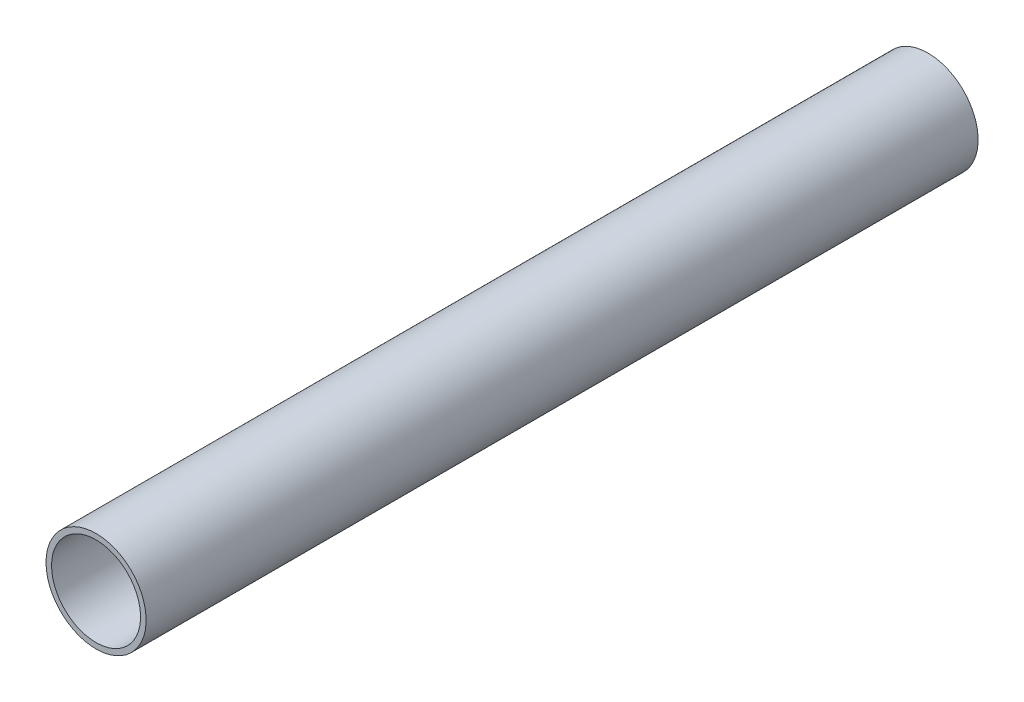
ISO-10303-21;
HEADER;
FILE_DESCRIPTION(('STEP AP214'),'2;1');
FILE_NAME('part.step','',(''),(''),'','','');
FILE_SCHEMA(('AUTOMOTIVE_DESIGN { 1 0 10303 214 1 1 1 1 }'));
ENDSEC;
DATA;
#1=APPLICATION_CONTEXT('core data for automotive mechanical design processes');
#2=APPLICATION_PROTOCOL_DEFINITION('international standard','automotive_design',2000,#1);
#3=PRODUCT_CONTEXT('',#1,'mechanical');
#4=PRODUCT('Part','Part','',(#3));
#5=PRODUCT_RELATED_PRODUCT_CATEGORY('part','',(#4));
#6=PRODUCT_DEFINITION_FORMATION('','',#4);
#7=PRODUCT_DEFINITION_CONTEXT('part definition',#1,'design');
#8=PRODUCT_DEFINITION('design','',#6,#7);
#9=PRODUCT_DEFINITION_SHAPE('','',#8);
#10=(LENGTH_UNIT() NAMED_UNIT(*) SI_UNIT(.MILLI.,.METRE.));
#11=(NAMED_UNIT(*) PLANE_ANGLE_UNIT() SI_UNIT($,.RADIAN.));
#12=(NAMED_UNIT(*) SI_UNIT($,.STERADIAN.) SOLID_ANGLE_UNIT());
#13=UNCERTAINTY_MEASURE_WITH_UNIT(LENGTH_MEASURE(1.E-05),#10,'distance_accuracy_value','');
#14=(GEOMETRIC_REPRESENTATION_CONTEXT(3) GLOBAL_UNCERTAINTY_ASSIGNED_CONTEXT((#13)) GLOBAL_UNIT_ASSIGNED_CONTEXT((#10,
#11,#12)) REPRESENTATION_CONTEXT('',''));
#15=CARTESIAN_POINT('',(0.,0.,0.));
#16=DIRECTION('',(0.,0.,1.));
#17=DIRECTION('',(1.,0.,0.));
#18=AXIS2_PLACEMENT_3D('',#15,#16,#17);
#19=CARTESIAN_POINT('',(0.,0.,475.));
#20=DIRECTION('',(0.,0.,-1.));
#21=DIRECTION('',(-1.,0.,0.));
#22=AXIS2_PLACEMENT_3D('',#19,#20,#21);
#23=CYLINDRICAL_SURFACE('',#22,50.8);
#24=CARTESIAN_POINT('',(0.,0.,-475.));
#25=DIRECTION('',(0.,0.,-1.));
#26=DIRECTION('',(-1.,0.,0.));
#27=AXIS2_PLACEMENT_3D('',#24,#25,#26);
#28=CIRCLE('',#27,50.8);
#29=CARTESIAN_POINT('',(-50.8,0.,-475.));
#30=VERTEX_POINT('',#29);
#31=EDGE_CURVE('E10',#30,#30,#28,.T.);
#32=ORIENTED_EDGE('',*,*,#31,.T.);
#33=EDGE_LOOP('',(#32));
#34=FACE_BOUND('',#33,.T.);
#35=CARTESIAN_POINT('',(0.,0.,475.));
#36=DIRECTION('',(0.,0.,-1.));
#37=DIRECTION('',(-1.,0.,0.));
#38=AXIS2_PLACEMENT_3D('',#35,#36,#37);
#39=CIRCLE('',#38,50.8);
#40=CARTESIAN_POINT('',(-50.8,0.,475.));
#41=VERTEX_POINT('',#40);
#42=EDGE_CURVE('E45',#41,#41,#39,.T.);
#43=ORIENTED_EDGE('',*,*,#42,.F.);
#44=EDGE_LOOP('',(#43));
#45=FACE_BOUND('',#44,.T.);
#46=ADVANCED_FACE('F31',(#34,#45),#23,.F.);
#47=CARTESIAN_POINT('',(50.8,0.,-475.));
#48=DIRECTION('',(0.,0.,-1.));
#49=DIRECTION('',(-1.,0.,0.));
#50=AXIS2_PLACEMENT_3D('',#47,#48,#49);
#51=PLANE('',#50);
#52=CARTESIAN_POINT('',(0.,0.,-475.));
#53=DIRECTION('',(0.,0.,-1.));
#54=DIRECTION('',(-1.,0.,0.));
#55=AXIS2_PLACEMENT_3D('',#52,#53,#54);
#56=CIRCLE('',#55,57.15);
#57=CARTESIAN_POINT('',(-57.15,0.,-475.));
#58=VERTEX_POINT('',#57);
#59=EDGE_CURVE('E37',#58,#58,#56,.T.);
#60=ORIENTED_EDGE('',*,*,#59,.T.);
#61=EDGE_LOOP('',(#60));
#62=FACE_BOUND('',#61,.T.);
#63=ORIENTED_EDGE('',*,*,#31,.F.);
#64=EDGE_LOOP('',(#63));
#65=FACE_BOUND('',#64,.T.);
#66=ADVANCED_FACE('F55',(#62,#65),#51,.T.);
#67=CARTESIAN_POINT('',(0.,0.,475.));
#68=DIRECTION('',(0.,0.,-1.));
#69=DIRECTION('',(-1.,0.,0.));
#70=AXIS2_PLACEMENT_3D('',#67,#68,#69);
#71=CYLINDRICAL_SURFACE('',#70,57.15);
#72=CARTESIAN_POINT('',(0.,0.,475.));
#73=DIRECTION('',(0.,0.,-1.));
#74=DIRECTION('',(-1.,0.,0.));
#75=AXIS2_PLACEMENT_3D('',#72,#73,#74);
#76=CIRCLE('',#75,57.15);
#77=CARTESIAN_POINT('',(-57.15,0.,475.));
#78=VERTEX_POINT('',#77);
#79=EDGE_CURVE('E41',#78,#78,#76,.T.);
#80=ORIENTED_EDGE('',*,*,#79,.T.);
#81=EDGE_LOOP('',(#80));
#82=FACE_BOUND('',#81,.T.);
#83=ORIENTED_EDGE('',*,*,#59,.F.);
#84=EDGE_LOOP('',(#83));
#85=FACE_BOUND('',#84,.T.);
#86=ADVANCED_FACE('F59',(#82,#85),#71,.T.);
#87=CARTESIAN_POINT('',(57.15,0.,475.));
#88=DIRECTION('',(0.,0.,1.));
#89=DIRECTION('',(1.,0.,0.));
#90=AXIS2_PLACEMENT_3D('',#87,#88,#89);
#91=PLANE('',#90);
#92=ORIENTED_EDGE('',*,*,#42,.T.);
#93=EDGE_LOOP('',(#92));
#94=FACE_BOUND('',#93,.T.);
#95=ORIENTED_EDGE('',*,*,#79,.F.);
#96=EDGE_LOOP('',(#95));
#97=FACE_BOUND('',#96,.T.);
#98=ADVANCED_FACE('F51',(#94,#97),#91,.T.);
#99=CLOSED_SHELL('',(#46,#66,#86,#98));
#100=MANIFOLD_SOLID_BREP('B2',#99);
#101=ADVANCED_BREP_SHAPE_REPRESENTATION('',(#18,#100),#14);
#102=SHAPE_DEFINITION_REPRESENTATION(#9,#101);
ENDSEC;
END-ISO-10303-21;
